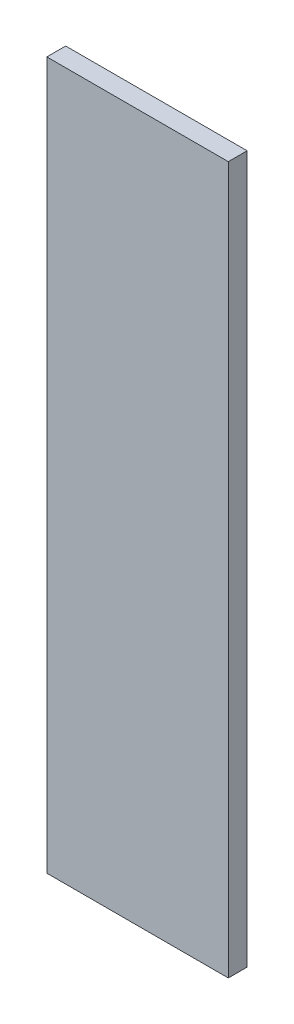
ISO-10303-21;
HEADER;
FILE_DESCRIPTION(('STEP AP214'),'2;1');
FILE_NAME('part.step','',(''),(''),'','','');
FILE_SCHEMA(('AUTOMOTIVE_DESIGN { 1 0 10303 214 1 1 1 1 }'));
ENDSEC;
DATA;
#1=APPLICATION_CONTEXT('core data for automotive mechanical design processes');
#2=APPLICATION_PROTOCOL_DEFINITION('international standard','automotive_design',2000,#1);
#3=PRODUCT_CONTEXT('',#1,'mechanical');
#4=PRODUCT('Part','Part','',(#3));
#5=PRODUCT_RELATED_PRODUCT_CATEGORY('part','',(#4));
#6=PRODUCT_DEFINITION_FORMATION('','',#4);
#7=PRODUCT_DEFINITION_CONTEXT('part definition',#1,'design');
#8=PRODUCT_DEFINITION('design','',#6,#7);
#9=PRODUCT_DEFINITION_SHAPE('','',#8);
#10=(LENGTH_UNIT() NAMED_UNIT(*) SI_UNIT(.MILLI.,.METRE.));
#11=(NAMED_UNIT(*) PLANE_ANGLE_UNIT() SI_UNIT($,.RADIAN.));
#12=(NAMED_UNIT(*) SI_UNIT($,.STERADIAN.) SOLID_ANGLE_UNIT());
#13=UNCERTAINTY_MEASURE_WITH_UNIT(LENGTH_MEASURE(1.E-05),#10,'distance_accuracy_value','');
#14=(GEOMETRIC_REPRESENTATION_CONTEXT(3) GLOBAL_UNCERTAINTY_ASSIGNED_CONTEXT((#13)) GLOBAL_UNIT_ASSIGNED_CONTEXT((#10,
#11,#12)) REPRESENTATION_CONTEXT('',''));
#15=CARTESIAN_POINT('',(0.,0.,0.));
#16=DIRECTION('',(0.,0.,1.));
#17=DIRECTION('',(1.,0.,0.));
#18=AXIS2_PLACEMENT_3D('',#15,#16,#17);
#19=CARTESIAN_POINT('',(-3.85,-15.,0.8));
#20=DIRECTION('',(1.,0.,0.));
#21=DIRECTION('',(0.,0.,-1.));
#22=AXIS2_PLACEMENT_3D('',#19,#20,#21);
#23=PLANE('',#22);
#24=DIRECTION('',(0.,-1.,0.));
#25=VECTOR('',#24,1.);
#26=CARTESIAN_POINT('',(-3.85,-15.,0.));
#27=LINE('',#26,#25);
#28=CARTESIAN_POINT('',(-3.85,15.,0.));
#29=VERTEX_POINT('',#28);
#30=CARTESIAN_POINT('',(-3.85,-15.,0.));
#31=VERTEX_POINT('',#30);
#32=EDGE_CURVE('E100',#29,#31,#27,.T.);
#33=ORIENTED_EDGE('',*,*,#32,.T.);
#34=DIRECTION('',(0.,0.,-1.));
#35=VECTOR('',#34,1.);
#36=CARTESIAN_POINT('',(-3.85,-15.,0.8));
#37=LINE('',#36,#35);
#38=CARTESIAN_POINT('',(-3.85,-15.,0.8));
#39=VERTEX_POINT('',#38);
#40=EDGE_CURVE('E11',#39,#31,#37,.T.);
#41=ORIENTED_EDGE('',*,*,#40,.F.);
#42=DIRECTION('',(0.,-1.,0.));
#43=VECTOR('',#42,1.);
#44=CARTESIAN_POINT('',(-3.85,-15.,0.8));
#45=LINE('',#44,#43);
#46=CARTESIAN_POINT('',(-3.85,15.,0.8));
#47=VERTEX_POINT('',#46);
#48=EDGE_CURVE('E88',#47,#39,#45,.T.);
#49=ORIENTED_EDGE('',*,*,#48,.F.);
#50=DIRECTION('',(0.,0.,-1.));
#51=VECTOR('',#50,1.);
#52=CARTESIAN_POINT('',(-3.85,15.,0.8));
#53=LINE('',#52,#51);
#54=EDGE_CURVE('E96',#47,#29,#53,.T.);
#55=ORIENTED_EDGE('',*,*,#54,.T.);
#56=EDGE_LOOP('',(#33,#41,#49,#55));
#57=FACE_BOUND('',#56,.T.);
#58=ADVANCED_FACE('F37',(#57),#23,.F.);
#59=CARTESIAN_POINT('',(3.85,-15.,0.8));
#60=DIRECTION('',(0.,1.,0.));
#61=DIRECTION('',(-1.,0.,0.));
#62=AXIS2_PLACEMENT_3D('',#59,#60,#61);
#63=PLANE('',#62);
#64=DIRECTION('',(1.,0.,0.));
#65=VECTOR('',#64,1.);
#66=CARTESIAN_POINT('',(3.85,-15.,0.));
#67=LINE('',#66,#65);
#68=CARTESIAN_POINT('',(3.85,-15.,0.));
#69=VERTEX_POINT('',#68);
#70=EDGE_CURVE('E92',#31,#69,#67,.T.);
#71=ORIENTED_EDGE('',*,*,#70,.T.);
#72=DIRECTION('',(0.,0.,-1.));
#73=VECTOR('',#72,1.);
#74=CARTESIAN_POINT('',(3.85,-15.,0.8));
#75=LINE('',#74,#73);
#76=CARTESIAN_POINT('',(3.85,-15.,0.8));
#77=VERTEX_POINT('',#76);
#78=EDGE_CURVE('E45',#77,#69,#75,.T.);
#79=ORIENTED_EDGE('',*,*,#78,.F.);
#80=DIRECTION('',(1.,0.,0.));
#81=VECTOR('',#80,1.);
#82=CARTESIAN_POINT('',(3.85,-15.,0.8));
#83=LINE('',#82,#81);
#84=EDGE_CURVE('E83',#39,#77,#83,.T.);
#85=ORIENTED_EDGE('',*,*,#84,.F.);
#86=ORIENTED_EDGE('',*,*,#40,.T.);
#87=EDGE_LOOP('',(#71,#79,#85,#86));
#88=FACE_BOUND('',#87,.T.);
#89=ADVANCED_FACE('F91',(#88),#63,.F.);
#90=CARTESIAN_POINT('',(3.85,-15.,0.8));
#91=DIRECTION('',(-1.,0.,0.));
#92=DIRECTION('',(0.,0.,1.));
#93=AXIS2_PLACEMENT_3D('',#90,#91,#92);
#94=PLANE('',#93);
#95=DIRECTION('',(0.,1.,0.));
#96=VECTOR('',#95,1.);
#97=CARTESIAN_POINT('',(3.85,-15.,0.));
#98=LINE('',#97,#96);
#99=CARTESIAN_POINT('',(3.85,15.,0.));
#100=VERTEX_POINT('',#99);
#101=EDGE_CURVE('E70',#69,#100,#98,.T.);
#102=ORIENTED_EDGE('',*,*,#101,.T.);
#103=DIRECTION('',(0.,0.,-1.));
#104=VECTOR('',#103,1.);
#105=CARTESIAN_POINT('',(3.85,15.,0.8));
#106=LINE('',#105,#104);
#107=CARTESIAN_POINT('',(3.85,15.,0.8));
#108=VERTEX_POINT('',#107);
#109=EDGE_CURVE('E93',#108,#100,#106,.T.);
#110=ORIENTED_EDGE('',*,*,#109,.F.);
#111=DIRECTION('',(0.,1.,0.));
#112=VECTOR('',#111,1.);
#113=CARTESIAN_POINT('',(3.85,-15.,0.8));
#114=LINE('',#113,#112);
#115=EDGE_CURVE('E86',#77,#108,#114,.T.);
#116=ORIENTED_EDGE('',*,*,#115,.F.);
#117=ORIENTED_EDGE('',*,*,#78,.T.);
#118=EDGE_LOOP('',(#102,#110,#116,#117));
#119=FACE_BOUND('',#118,.T.);
#120=ADVANCED_FACE('F94',(#119),#94,.F.);
#121=CARTESIAN_POINT('',(3.85,15.,0.8));
#122=DIRECTION('',(0.,-1.,0.));
#123=DIRECTION('',(1.,0.,0.));
#124=AXIS2_PLACEMENT_3D('',#121,#122,#123);
#125=PLANE('',#124);
#126=DIRECTION('',(-1.,0.,0.));
#127=VECTOR('',#126,1.);
#128=CARTESIAN_POINT('',(3.85,15.,0.));
#129=LINE('',#128,#127);
#130=EDGE_CURVE('E76',#100,#29,#129,.T.);
#131=ORIENTED_EDGE('',*,*,#130,.T.);
#132=ORIENTED_EDGE('',*,*,#54,.F.);
#133=DIRECTION('',(-1.,0.,0.));
#134=VECTOR('',#133,1.);
#135=CARTESIAN_POINT('',(3.85,15.,0.8));
#136=LINE('',#135,#134);
#137=EDGE_CURVE('E53',#108,#47,#136,.T.);
#138=ORIENTED_EDGE('',*,*,#137,.F.);
#139=ORIENTED_EDGE('',*,*,#109,.T.);
#140=EDGE_LOOP('',(#131,#132,#138,#139));
#141=FACE_BOUND('',#140,.T.);
#142=ADVANCED_FACE('F107',(#141),#125,.F.);
#143=CARTESIAN_POINT('',(0.,0.,0.8));
#144=DIRECTION('',(0.,0.,1.));
#145=DIRECTION('',(1.,0.,0.));
#146=AXIS2_PLACEMENT_3D('',#143,#144,#145);
#147=PLANE('',#146);
#148=ORIENTED_EDGE('',*,*,#48,.T.);
#149=ORIENTED_EDGE('',*,*,#84,.T.);
#150=ORIENTED_EDGE('',*,*,#115,.T.);
#151=ORIENTED_EDGE('',*,*,#137,.T.);
#152=EDGE_LOOP('',(#148,#149,#150,#151));
#153=FACE_BOUND('',#152,.T.);
#154=ADVANCED_FACE('F84',(#153),#147,.T.);
#155=CARTESIAN_POINT('',(0.,0.,0.));
#156=DIRECTION('',(0.,0.,1.));
#157=DIRECTION('',(1.,0.,0.));
#158=AXIS2_PLACEMENT_3D('',#155,#156,#157);
#159=PLANE('',#158);
#160=ORIENTED_EDGE('',*,*,#32,.F.);
#161=ORIENTED_EDGE('',*,*,#130,.F.);
#162=ORIENTED_EDGE('',*,*,#101,.F.);
#163=ORIENTED_EDGE('',*,*,#70,.F.);
#164=EDGE_LOOP('',(#160,#161,#162,#163));
#165=FACE_BOUND('',#164,.T.);
#166=ADVANCED_FACE('F110',(#165),#159,.F.);
#167=CLOSED_SHELL('',(#58,#89,#120,#142,#154,#166));
#168=MANIFOLD_SOLID_BREP('B2',#167);
#169=ADVANCED_BREP_SHAPE_REPRESENTATION('',(#18,#168),#14);
#170=SHAPE_DEFINITION_REPRESENTATION(#9,#169);
ENDSEC;
END-ISO-10303-21;
